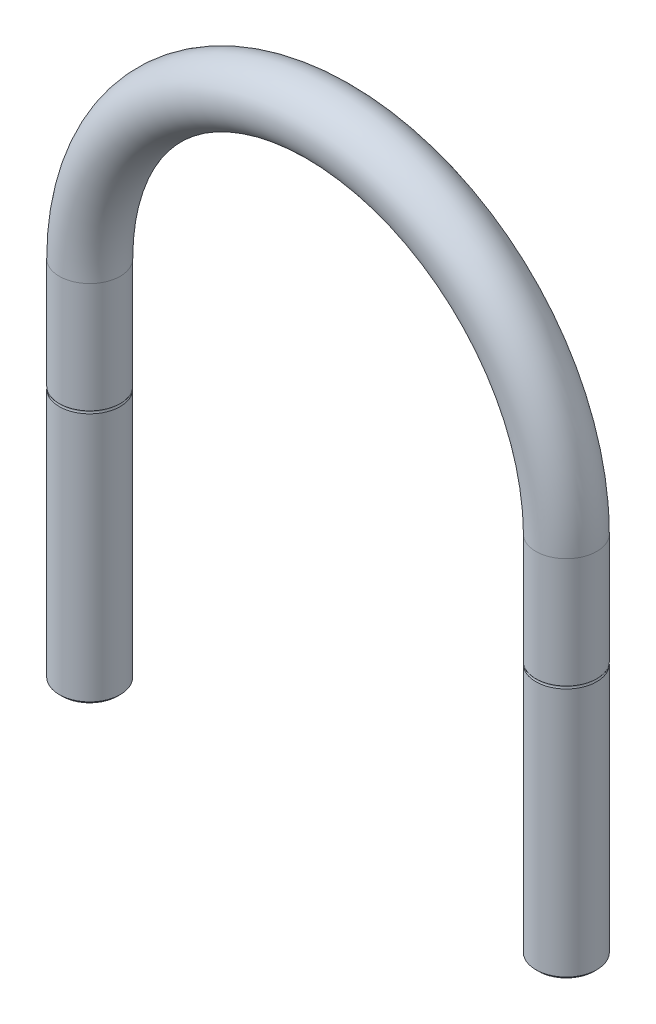
ISO-10303-21;
HEADER;
FILE_DESCRIPTION(('STEP AP214'),'2;1');
FILE_NAME('part.step','',(''),(''),'','','');
FILE_SCHEMA(('AUTOMOTIVE_DESIGN { 1 0 10303 214 1 1 1 1 }'));
ENDSEC;
DATA;
#1=APPLICATION_CONTEXT('core data for automotive mechanical design processes');
#2=APPLICATION_PROTOCOL_DEFINITION('international standard','automotive_design',2000,#1);
#3=PRODUCT_CONTEXT('',#1,'mechanical');
#4=PRODUCT('Part','Part','',(#3));
#5=PRODUCT_RELATED_PRODUCT_CATEGORY('part','',(#4));
#6=PRODUCT_DEFINITION_FORMATION('','',#4);
#7=PRODUCT_DEFINITION_CONTEXT('part definition',#1,'design');
#8=PRODUCT_DEFINITION('design','',#6,#7);
#9=PRODUCT_DEFINITION_SHAPE('','',#8);
#10=(LENGTH_UNIT() NAMED_UNIT(*) SI_UNIT(.MILLI.,.METRE.));
#11=(NAMED_UNIT(*) PLANE_ANGLE_UNIT() SI_UNIT($,.RADIAN.));
#12=(NAMED_UNIT(*) SI_UNIT($,.STERADIAN.) SOLID_ANGLE_UNIT());
#13=UNCERTAINTY_MEASURE_WITH_UNIT(LENGTH_MEASURE(1.E-05),#10,'distance_accuracy_value','');
#14=(GEOMETRIC_REPRESENTATION_CONTEXT(3) GLOBAL_UNCERTAINTY_ASSIGNED_CONTEXT((#13)) GLOBAL_UNIT_ASSIGNED_CONTEXT((#10,
#11,#12)) REPRESENTATION_CONTEXT('',''));
#15=CARTESIAN_POINT('',(0.,0.,0.));
#16=DIRECTION('',(0.,0.,1.));
#17=DIRECTION('',(1.,0.,0.));
#18=AXIS2_PLACEMENT_3D('',#15,#16,#17);
#19=CARTESIAN_POINT('',(0.,0.,0.));
#20=DIRECTION('',(0.,0.,-1.));
#21=DIRECTION('',(0.,1.,0.));
#22=AXIS2_PLACEMENT_3D('',#19,#20,#21);
#23=TOROIDAL_SURFACE('',#22,47.,6.);
#24=CARTESIAN_POINT('',(-47.,0.,0.));
#25=DIRECTION('',(0.,1.,0.));
#26=DIRECTION('',(-1.,0.,0.));
#27=AXIS2_PLACEMENT_3D('',#24,#25,#26);
#28=CIRCLE('',#27,6.);
#29=CARTESIAN_POINT('',(-41.,0.,0.));
#30=VERTEX_POINT('',#29);
#31=EDGE_CURVE('E49',#30,#30,#28,.T.);
#32=ORIENTED_EDGE('',*,*,#31,.T.);
#33=EDGE_LOOP('',(#32));
#34=FACE_BOUND('',#33,.T.);
#35=CARTESIAN_POINT('',(47.,0.,0.));
#36=DIRECTION('',(0.,1.,0.));
#37=DIRECTION('',(1.,0.,0.));
#38=AXIS2_PLACEMENT_3D('',#35,#36,#37);
#39=CIRCLE('',#38,6.);
#40=CARTESIAN_POINT('',(41.,0.,0.));
#41=VERTEX_POINT('',#40);
#42=EDGE_CURVE('E10',#41,#41,#39,.T.);
#43=ORIENTED_EDGE('',*,*,#42,.T.);
#44=EDGE_LOOP('',(#43));
#45=FACE_BOUND('',#44,.T.);
#46=ADVANCED_FACE('F15',(#34,#45),#23,.T.);
#47=CARTESIAN_POINT('',(47.,-72.,0.));
#48=DIRECTION('',(0.,-1.,0.));
#49=DIRECTION('',(-1.,0.,0.));
#50=AXIS2_PLACEMENT_3D('',#47,#48,#49);
#51=PLANE('',#50);
#52=CARTESIAN_POINT('',(47.,-72.,0.));
#53=DIRECTION('',(0.,-1.,0.));
#54=DIRECTION('',(1.,0.,0.));
#55=AXIS2_PLACEMENT_3D('',#52,#53,#54);
#56=CIRCLE('',#55,5.45875);
#57=CARTESIAN_POINT('',(52.45875,-72.,0.));
#58=VERTEX_POINT('',#57);
#59=EDGE_CURVE('E19',#58,#58,#56,.T.);
#60=ORIENTED_EDGE('',*,*,#59,.T.);
#61=EDGE_LOOP('',(#60));
#62=FACE_BOUND('',#61,.T.);
#63=ADVANCED_FACE('F17',(#62),#51,.T.);
#64=CARTESIAN_POINT('',(47.,-36.,0.));
#65=DIRECTION('',(0.,-1.,0.));
#66=DIRECTION('',(1.,0.,0.));
#67=AXIS2_PLACEMENT_3D('',#64,#65,#66);
#68=CYLINDRICAL_SURFACE('',#67,6.);
#69=ORIENTED_EDGE('',*,*,#42,.F.);
#70=EDGE_LOOP('',(#69));
#71=FACE_BOUND('',#70,.T.);
#72=CARTESIAN_POINT('',(47.,-21.75,0.));
#73=DIRECTION('',(0.,1.,0.));
#74=DIRECTION('',(1.,0.,0.));
#75=AXIS2_PLACEMENT_3D('',#72,#73,#74);
#76=CIRCLE('',#75,6.);
#77=CARTESIAN_POINT('',(53.,-21.75,0.));
#78=VERTEX_POINT('',#77);
#79=EDGE_CURVE('E74',#78,#78,#76,.T.);
#80=ORIENTED_EDGE('',*,*,#79,.T.);
#81=EDGE_LOOP('',(#80));
#82=FACE_BOUND('',#81,.T.);
#83=ADVANCED_FACE('F85',(#71,#82),#68,.T.);
#84=CARTESIAN_POINT('',(47.,-71.729375,0.));
#85=DIRECTION('',(0.,1.,0.));
#86=DIRECTION('',(1.,0.,0.));
#87=AXIS2_PLACEMENT_3D('',#84,#85,#86);
#88=CONICAL_SURFACE('',#87,5.729375,0.785398163397448);
#89=ORIENTED_EDGE('',*,*,#59,.F.);
#90=EDGE_LOOP('',(#89));
#91=FACE_BOUND('',#90,.T.);
#92=CARTESIAN_POINT('',(47.,-71.45875,0.));
#93=DIRECTION('',(0.,1.,0.));
#94=DIRECTION('',(1.,0.,0.));
#95=AXIS2_PLACEMENT_3D('',#92,#93,#94);
#96=CIRCLE('',#95,6.);
#97=CARTESIAN_POINT('',(53.,-71.45875,0.));
#98=VERTEX_POINT('',#97);
#99=EDGE_CURVE('E76',#98,#98,#96,.T.);
#100=ORIENTED_EDGE('',*,*,#99,.F.);
#101=EDGE_LOOP('',(#100));
#102=FACE_BOUND('',#101,.T.);
#103=ADVANCED_FACE('F83',(#91,#102),#88,.T.);
#104=CARTESIAN_POINT('',(47.,-36.,0.));
#105=DIRECTION('',(0.,-1.,0.));
#106=DIRECTION('',(1.,0.,0.));
#107=AXIS2_PLACEMENT_3D('',#104,#105,#106);
#108=CYLINDRICAL_SURFACE('',#107,6.);
#109=ORIENTED_EDGE('',*,*,#99,.T.);
#110=EDGE_LOOP('',(#109));
#111=FACE_BOUND('',#110,.T.);
#112=CARTESIAN_POINT('',(47.,-22.25,0.));
#113=DIRECTION('',(0.,-1.,0.));
#114=DIRECTION('',(1.,0.,0.));
#115=AXIS2_PLACEMENT_3D('',#112,#113,#114);
#116=CIRCLE('',#115,6.);
#117=CARTESIAN_POINT('',(53.,-22.25,0.));
#118=VERTEX_POINT('',#117);
#119=EDGE_CURVE('E77',#118,#118,#116,.T.);
#120=ORIENTED_EDGE('',*,*,#119,.T.);
#121=EDGE_LOOP('',(#120));
#122=FACE_BOUND('',#121,.T.);
#123=ADVANCED_FACE('F80',(#111,#122),#108,.T.);
#124=CARTESIAN_POINT('',(47.,-22.,0.));
#125=DIRECTION('',(0.,1.,0.));
#126=DIRECTION('',(0.,0.,1.));
#127=AXIS2_PLACEMENT_3D('',#124,#125,#126);
#128=TOROIDAL_SURFACE('',#127,6.43301270189222,0.5);
#129=ORIENTED_EDGE('',*,*,#79,.F.);
#130=EDGE_LOOP('',(#129));
#131=FACE_BOUND('',#130,.T.);
#132=ORIENTED_EDGE('',*,*,#119,.F.);
#133=EDGE_LOOP('',(#132));
#134=FACE_BOUND('',#133,.T.);
#135=ADVANCED_FACE('F93',(#131,#134),#128,.F.);
#136=CARTESIAN_POINT('',(-47.,-72.,0.));
#137=DIRECTION('',(0.,-1.,0.));
#138=DIRECTION('',(-1.,0.,0.));
#139=AXIS2_PLACEMENT_3D('',#136,#137,#138);
#140=PLANE('',#139);
#141=CARTESIAN_POINT('',(-47.,-72.,0.));
#142=DIRECTION('',(0.,-1.,0.));
#143=DIRECTION('',(1.,0.,0.));
#144=AXIS2_PLACEMENT_3D('',#141,#142,#143);
#145=CIRCLE('',#144,5.45875);
#146=CARTESIAN_POINT('',(-41.54125,-72.,0.));
#147=VERTEX_POINT('',#146);
#148=EDGE_CURVE('E56',#147,#147,#145,.T.);
#149=ORIENTED_EDGE('',*,*,#148,.T.);
#150=EDGE_LOOP('',(#149));
#151=FACE_BOUND('',#150,.T.);
#152=ADVANCED_FACE('F105',(#151),#140,.T.);
#153=CARTESIAN_POINT('',(-47.,-36.,0.));
#154=DIRECTION('',(0.,-1.,0.));
#155=DIRECTION('',(1.,0.,0.));
#156=AXIS2_PLACEMENT_3D('',#153,#154,#155);
#157=CYLINDRICAL_SURFACE('',#156,6.);
#158=ORIENTED_EDGE('',*,*,#31,.F.);
#159=EDGE_LOOP('',(#158));
#160=FACE_BOUND('',#159,.T.);
#161=CARTESIAN_POINT('',(-47.,-21.75,0.));
#162=DIRECTION('',(0.,1.,0.));
#163=DIRECTION('',(1.,0.,0.));
#164=AXIS2_PLACEMENT_3D('',#161,#162,#163);
#165=CIRCLE('',#164,6.);
#166=CARTESIAN_POINT('',(-41.,-21.75,0.));
#167=VERTEX_POINT('',#166);
#168=EDGE_CURVE('E66',#167,#167,#165,.T.);
#169=ORIENTED_EDGE('',*,*,#168,.T.);
#170=EDGE_LOOP('',(#169));
#171=FACE_BOUND('',#170,.T.);
#172=ADVANCED_FACE('F67',(#160,#171),#157,.T.);
#173=CARTESIAN_POINT('',(-47.,-71.729375,0.));
#174=DIRECTION('',(0.,1.,0.));
#175=DIRECTION('',(1.,0.,0.));
#176=AXIS2_PLACEMENT_3D('',#173,#174,#175);
#177=CONICAL_SURFACE('',#176,5.729375,0.785398163397448);
#178=ORIENTED_EDGE('',*,*,#148,.F.);
#179=EDGE_LOOP('',(#178));
#180=FACE_BOUND('',#179,.T.);
#181=CARTESIAN_POINT('',(-47.,-71.45875,0.));
#182=DIRECTION('',(0.,1.,0.));
#183=DIRECTION('',(1.,0.,0.));
#184=AXIS2_PLACEMENT_3D('',#181,#182,#183);
#185=CIRCLE('',#184,6.);
#186=CARTESIAN_POINT('',(-41.,-71.45875,0.));
#187=VERTEX_POINT('',#186);
#188=EDGE_CURVE('E61',#187,#187,#185,.T.);
#189=ORIENTED_EDGE('',*,*,#188,.F.);
#190=EDGE_LOOP('',(#189));
#191=FACE_BOUND('',#190,.T.);
#192=ADVANCED_FACE('F107',(#180,#191),#177,.T.);
#193=CARTESIAN_POINT('',(-47.,-36.,0.));
#194=DIRECTION('',(0.,-1.,0.));
#195=DIRECTION('',(1.,0.,0.));
#196=AXIS2_PLACEMENT_3D('',#193,#194,#195);
#197=CYLINDRICAL_SURFACE('',#196,6.);
#198=ORIENTED_EDGE('',*,*,#188,.T.);
#199=EDGE_LOOP('',(#198));
#200=FACE_BOUND('',#199,.T.);
#201=CARTESIAN_POINT('',(-47.,-22.25,0.));
#202=DIRECTION('',(0.,-1.,0.));
#203=DIRECTION('',(1.,0.,0.));
#204=AXIS2_PLACEMENT_3D('',#201,#202,#203);
#205=CIRCLE('',#204,6.);
#206=CARTESIAN_POINT('',(-41.,-22.25,0.));
#207=VERTEX_POINT('',#206);
#208=EDGE_CURVE('E69',#207,#207,#205,.T.);
#209=ORIENTED_EDGE('',*,*,#208,.T.);
#210=EDGE_LOOP('',(#209));
#211=FACE_BOUND('',#210,.T.);
#212=ADVANCED_FACE('F110',(#200,#211),#197,.T.);
#213=CARTESIAN_POINT('',(-47.,-22.,0.));
#214=DIRECTION('',(0.,1.,0.));
#215=DIRECTION('',(0.,0.,1.));
#216=AXIS2_PLACEMENT_3D('',#213,#214,#215);
#217=TOROIDAL_SURFACE('',#216,6.43301270189222,0.5);
#218=ORIENTED_EDGE('',*,*,#168,.F.);
#219=EDGE_LOOP('',(#218));
#220=FACE_BOUND('',#219,.T.);
#221=ORIENTED_EDGE('',*,*,#208,.F.);
#222=EDGE_LOOP('',(#221));
#223=FACE_BOUND('',#222,.T.);
#224=ADVANCED_FACE('F113',(#220,#223),#217,.F.);
#225=CLOSED_SHELL('',(#46,#63,#83,#103,#123,#135,#152,#172,#192,#212,#224));
#226=MANIFOLD_SOLID_BREP('B1',#225);
#227=ADVANCED_BREP_SHAPE_REPRESENTATION('',(#18,#226),#14);
#228=SHAPE_DEFINITION_REPRESENTATION(#9,#227);
ENDSEC;
END-ISO-10303-21;
